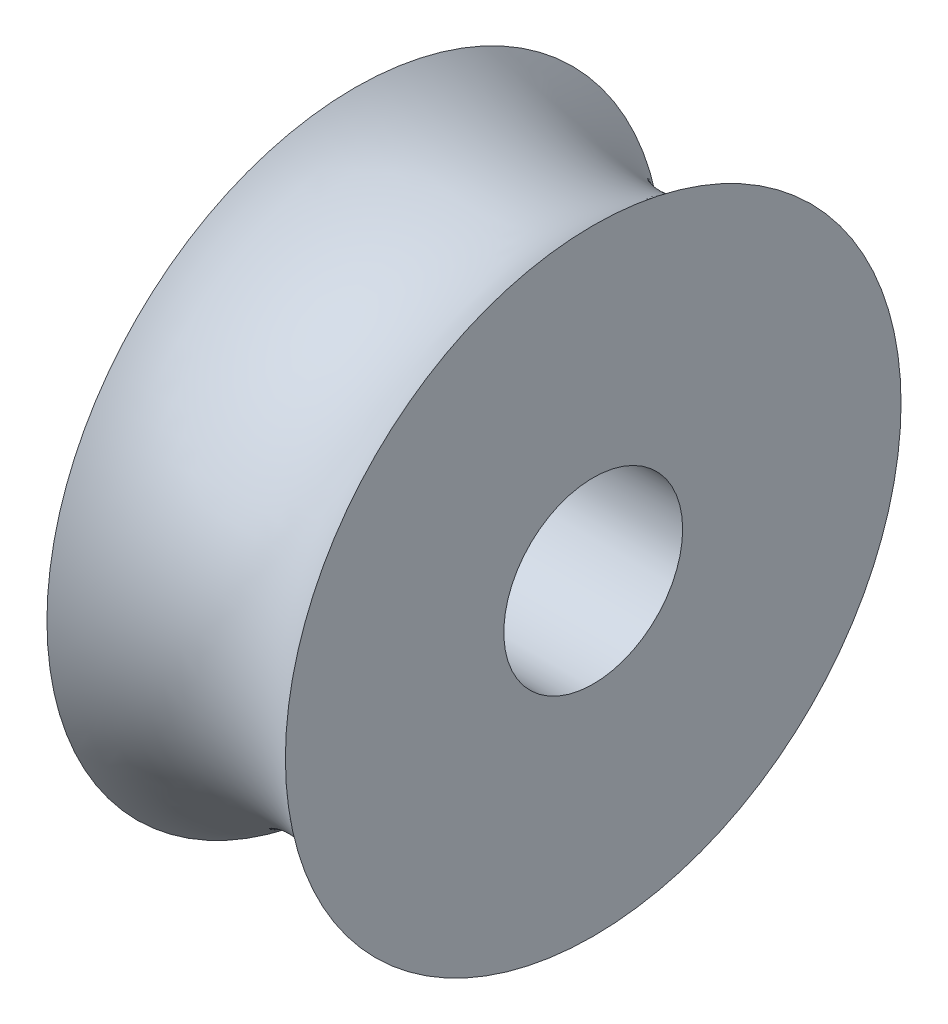
ISO-10303-21;
HEADER;
FILE_DESCRIPTION(('STEP AP214'),'2;1');
FILE_NAME('part.step','',(''),(''),'','','');
FILE_SCHEMA(('AUTOMOTIVE_DESIGN { 1 0 10303 214 1 1 1 1 }'));
ENDSEC;
DATA;
#1=APPLICATION_CONTEXT('core data for automotive mechanical design processes');
#2=APPLICATION_PROTOCOL_DEFINITION('international standard','automotive_design',2000,#1);
#3=PRODUCT_CONTEXT('',#1,'mechanical');
#4=PRODUCT('Part','Part','',(#3));
#5=PRODUCT_RELATED_PRODUCT_CATEGORY('part','',(#4));
#6=PRODUCT_DEFINITION_FORMATION('','',#4);
#7=PRODUCT_DEFINITION_CONTEXT('part definition',#1,'design');
#8=PRODUCT_DEFINITION('design','',#6,#7);
#9=PRODUCT_DEFINITION_SHAPE('','',#8);
#10=(LENGTH_UNIT() NAMED_UNIT(*) SI_UNIT(.MILLI.,.METRE.));
#11=(NAMED_UNIT(*) PLANE_ANGLE_UNIT() SI_UNIT($,.RADIAN.));
#12=(NAMED_UNIT(*) SI_UNIT($,.STERADIAN.) SOLID_ANGLE_UNIT());
#13=UNCERTAINTY_MEASURE_WITH_UNIT(LENGTH_MEASURE(1.E-05),#10,'distance_accuracy_value','');
#14=(GEOMETRIC_REPRESENTATION_CONTEXT(3) GLOBAL_UNCERTAINTY_ASSIGNED_CONTEXT((#13)) GLOBAL_UNIT_ASSIGNED_CONTEXT((#10,
#11,#12)) REPRESENTATION_CONTEXT('',''));
#15=CARTESIAN_POINT('',(0.,0.,0.));
#16=DIRECTION('',(0.,0.,1.));
#17=DIRECTION('',(1.,0.,0.));
#18=AXIS2_PLACEMENT_3D('',#15,#16,#17);
#19=CARTESIAN_POINT('',(-3.175,0.,0.));
#20=DIRECTION('',(1.,0.,0.));
#21=DIRECTION('',(0.,0.,-1.));
#22=AXIS2_PLACEMENT_3D('',#19,#20,#21);
#23=PLANE('',#22);
#24=CARTESIAN_POINT('',(-3.175,0.,0.));
#25=DIRECTION('',(1.,0.,0.));
#26=DIRECTION('',(0.,0.,-1.));
#27=AXIS2_PLACEMENT_3D('',#24,#25,#26);
#28=CIRCLE('',#27,2.38125);
#29=CARTESIAN_POINT('',(-3.175,0.,-2.38125));
#30=VERTEX_POINT('',#29);
#31=EDGE_CURVE('E40',#30,#30,#28,.T.);
#32=ORIENTED_EDGE('',*,*,#31,.T.);
#33=EDGE_LOOP('',(#32));
#34=FACE_BOUND('',#33,.T.);
#35=CARTESIAN_POINT('',(-3.175,0.,0.));
#36=DIRECTION('',(-1.,0.,0.));
#37=DIRECTION('',(0.,0.,1.));
#38=AXIS2_PLACEMENT_3D('',#35,#36,#37);
#39=CIRCLE('',#38,8.19774208571908);
#40=CARTESIAN_POINT('',(-3.175,0.,8.19774208571908));
#41=VERTEX_POINT('',#40);
#42=EDGE_CURVE('E36',#41,#41,#39,.T.);
#43=ORIENTED_EDGE('',*,*,#42,.T.);
#44=EDGE_LOOP('',(#43));
#45=FACE_BOUND('',#44,.T.);
#46=ADVANCED_FACE('F30',(#34,#45),#23,.F.);
#47=CARTESIAN_POINT('',(3.175,0.,0.));
#48=DIRECTION('',(-1.,0.,0.));
#49=DIRECTION('',(0.,0.,1.));
#50=AXIS2_PLACEMENT_3D('',#47,#48,#49);
#51=PLANE('',#50);
#52=CARTESIAN_POINT('',(3.175,0.,0.));
#53=DIRECTION('',(1.,0.,0.));
#54=DIRECTION('',(0.,0.,-1.));
#55=AXIS2_PLACEMENT_3D('',#52,#53,#54);
#56=CIRCLE('',#55,2.38125);
#57=CARTESIAN_POINT('',(3.175,0.,-2.38125));
#58=VERTEX_POINT('',#57);
#59=EDGE_CURVE('E44',#58,#58,#56,.T.);
#60=ORIENTED_EDGE('',*,*,#59,.F.);
#61=EDGE_LOOP('',(#60));
#62=FACE_BOUND('',#61,.T.);
#63=CARTESIAN_POINT('',(3.175,0.,0.));
#64=DIRECTION('',(-1.,0.,0.));
#65=DIRECTION('',(0.,0.,1.));
#66=AXIS2_PLACEMENT_3D('',#63,#64,#65);
#67=CIRCLE('',#66,8.19774208571908);
#68=CARTESIAN_POINT('',(3.175,0.,8.19774208571908));
#69=VERTEX_POINT('',#68);
#70=EDGE_CURVE('E10',#69,#69,#67,.T.);
#71=ORIENTED_EDGE('',*,*,#70,.F.);
#72=EDGE_LOOP('',(#71));
#73=FACE_BOUND('',#72,.T.);
#74=ADVANCED_FACE('F52',(#62,#73),#51,.F.);
#75=CARTESIAN_POINT('',(0.,0.,0.));
#76=DIRECTION('',(-1.,0.,0.));
#77=DIRECTION('',(0.,0.,1.));
#78=AXIS2_PLACEMENT_3D('',#75,#76,#77);
#79=TOROIDAL_SURFACE('',#78,11.7475,4.7625);
#80=ORIENTED_EDGE('',*,*,#42,.F.);
#81=EDGE_LOOP('',(#80));
#82=FACE_BOUND('',#81,.T.);
#83=ORIENTED_EDGE('',*,*,#70,.T.);
#84=EDGE_LOOP('',(#83));
#85=FACE_BOUND('',#84,.T.);
#86=ADVANCED_FACE('F55',(#82,#85),#79,.F.);
#87=CARTESIAN_POINT('',(-3.175,0.,0.));
#88=DIRECTION('',(1.,0.,0.));
#89=DIRECTION('',(0.,0.,-1.));
#90=AXIS2_PLACEMENT_3D('',#87,#88,#89);
#91=CYLINDRICAL_SURFACE('',#90,2.38125);
#92=ORIENTED_EDGE('',*,*,#31,.F.);
#93=EDGE_LOOP('',(#92));
#94=FACE_BOUND('',#93,.T.);
#95=ORIENTED_EDGE('',*,*,#59,.T.);
#96=EDGE_LOOP('',(#95));
#97=FACE_BOUND('',#96,.T.);
#98=ADVANCED_FACE('F50',(#94,#97),#91,.F.);
#99=CLOSED_SHELL('',(#46,#74,#86,#98));
#100=MANIFOLD_SOLID_BREP('B2',#99);
#101=ADVANCED_BREP_SHAPE_REPRESENTATION('',(#18,#100),#14);
#102=SHAPE_DEFINITION_REPRESENTATION(#9,#101);
ENDSEC;
END-ISO-10303-21;
